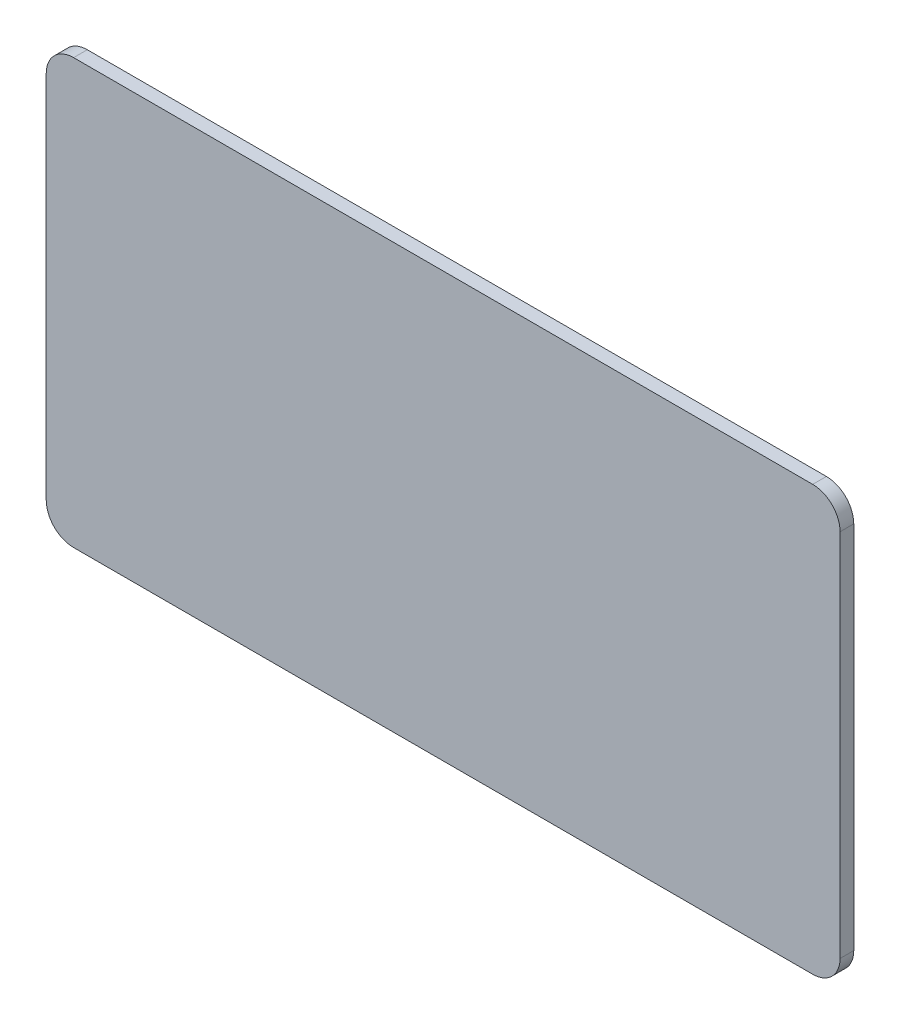
ISO-10303-21;
HEADER;
FILE_DESCRIPTION(('STEP AP214'),'2;1');
FILE_NAME('part.step','',(''),(''),'','','');
FILE_SCHEMA(('AUTOMOTIVE_DESIGN { 1 0 10303 214 1 1 1 1 }'));
ENDSEC;
DATA;
#1=APPLICATION_CONTEXT('core data for automotive mechanical design processes');
#2=APPLICATION_PROTOCOL_DEFINITION('international standard','automotive_design',2000,#1);
#3=PRODUCT_CONTEXT('',#1,'mechanical');
#4=PRODUCT('Part','Part','',(#3));
#5=PRODUCT_RELATED_PRODUCT_CATEGORY('part','',(#4));
#6=PRODUCT_DEFINITION_FORMATION('','',#4);
#7=PRODUCT_DEFINITION_CONTEXT('part definition',#1,'design');
#8=PRODUCT_DEFINITION('design','',#6,#7);
#9=PRODUCT_DEFINITION_SHAPE('','',#8);
#10=(LENGTH_UNIT() NAMED_UNIT(*) SI_UNIT(.MILLI.,.METRE.));
#11=(NAMED_UNIT(*) PLANE_ANGLE_UNIT() SI_UNIT($,.RADIAN.));
#12=(NAMED_UNIT(*) SI_UNIT($,.STERADIAN.) SOLID_ANGLE_UNIT());
#13=UNCERTAINTY_MEASURE_WITH_UNIT(LENGTH_MEASURE(1.E-05),#10,'distance_accuracy_value','');
#14=(GEOMETRIC_REPRESENTATION_CONTEXT(3) GLOBAL_UNCERTAINTY_ASSIGNED_CONTEXT((#13)) GLOBAL_UNIT_ASSIGNED_CONTEXT((#10,
#11,#12)) REPRESENTATION_CONTEXT('',''));
#15=CARTESIAN_POINT('',(0.,0.,0.));
#16=DIRECTION('',(0.,0.,1.));
#17=DIRECTION('',(1.,0.,0.));
#18=AXIS2_PLACEMENT_3D('',#15,#16,#17);
#19=CARTESIAN_POINT('',(9.99999999999997,145.,5.));
#20=DIRECTION('',(0.,0.,-1.));
#21=DIRECTION('',(-1.,0.,0.));
#22=AXIS2_PLACEMENT_3D('',#19,#20,#21);
#23=CYLINDRICAL_SURFACE('',#22,10.);
#24=CARTESIAN_POINT('',(9.99999999999997,145.,0.));
#25=DIRECTION('',(0.,0.,1.));
#26=DIRECTION('',(-1.,0.,0.));
#27=AXIS2_PLACEMENT_3D('',#24,#25,#26);
#28=CIRCLE('',#27,10.);
#29=CARTESIAN_POINT('',(10.,155.,0.));
#30=VERTEX_POINT('',#29);
#31=CARTESIAN_POINT('',(0.,145.,0.));
#32=VERTEX_POINT('',#31);
#33=EDGE_CURVE('E129',#30,#32,#28,.T.);
#34=ORIENTED_EDGE('',*,*,#33,.T.);
#35=DIRECTION('',(0.,0.,-1.));
#36=VECTOR('',#35,1.);
#37=CARTESIAN_POINT('',(0.,145.,5.));
#38=LINE('',#37,#36);
#39=CARTESIAN_POINT('',(0.,145.,5.));
#40=VERTEX_POINT('',#39);
#41=EDGE_CURVE('E11',#40,#32,#38,.T.);
#42=ORIENTED_EDGE('',*,*,#41,.F.);
#43=CARTESIAN_POINT('',(9.99999999999997,145.,5.));
#44=DIRECTION('',(0.,0.,1.));
#45=DIRECTION('',(-1.,0.,0.));
#46=AXIS2_PLACEMENT_3D('',#43,#44,#45);
#47=CIRCLE('',#46,10.);
#48=CARTESIAN_POINT('',(10.,155.,5.));
#49=VERTEX_POINT('',#48);
#50=EDGE_CURVE('E143',#49,#40,#47,.T.);
#51=ORIENTED_EDGE('',*,*,#50,.F.);
#52=DIRECTION('',(0.,0.,-1.));
#53=VECTOR('',#52,1.);
#54=CARTESIAN_POINT('',(10.,155.,5.));
#55=LINE('',#54,#53);
#56=EDGE_CURVE('E125',#49,#30,#55,.T.);
#57=ORIENTED_EDGE('',*,*,#56,.T.);
#58=EDGE_LOOP('',(#34,#42,#51,#57));
#59=FACE_BOUND('',#58,.T.);
#60=ADVANCED_FACE('F33',(#59),#23,.T.);
#61=CARTESIAN_POINT('',(0.,10.0000000000001,5.));
#62=DIRECTION('',(1.,0.,0.));
#63=DIRECTION('',(0.,1.,0.));
#64=AXIS2_PLACEMENT_3D('',#61,#62,#63);
#65=PLANE('',#64);
#66=DIRECTION('',(0.,-1.,0.));
#67=VECTOR('',#66,1.);
#68=CARTESIAN_POINT('',(0.,10.0000000000001,0.));
#69=LINE('',#68,#67);
#70=CARTESIAN_POINT('',(0.,10.0000000000001,0.));
#71=VERTEX_POINT('',#70);
#72=EDGE_CURVE('E132',#32,#71,#69,.T.);
#73=ORIENTED_EDGE('',*,*,#72,.T.);
#74=DIRECTION('',(0.,0.,-1.));
#75=VECTOR('',#74,1.);
#76=CARTESIAN_POINT('',(0.,10.0000000000001,5.));
#77=LINE('',#76,#75);
#78=CARTESIAN_POINT('',(0.,10.0000000000001,5.));
#79=VERTEX_POINT('',#78);
#80=EDGE_CURVE('E41',#79,#71,#77,.T.);
#81=ORIENTED_EDGE('',*,*,#80,.F.);
#82=DIRECTION('',(0.,-1.,0.));
#83=VECTOR('',#82,1.);
#84=CARTESIAN_POINT('',(0.,10.0000000000001,5.));
#85=LINE('',#84,#83);
#86=EDGE_CURVE('E92',#40,#79,#85,.T.);
#87=ORIENTED_EDGE('',*,*,#86,.F.);
#88=ORIENTED_EDGE('',*,*,#41,.T.);
#89=EDGE_LOOP('',(#73,#81,#87,#88));
#90=FACE_BOUND('',#89,.T.);
#91=ADVANCED_FACE('F178',(#90),#65,.F.);
#92=CARTESIAN_POINT('',(10.,10.,5.));
#93=DIRECTION('',(0.,0.,-1.));
#94=DIRECTION('',(-1.,0.,0.));
#95=AXIS2_PLACEMENT_3D('',#92,#93,#94);
#96=CYLINDRICAL_SURFACE('',#95,10.);
#97=CARTESIAN_POINT('',(10.,10.,0.));
#98=DIRECTION('',(0.,0.,1.));
#99=DIRECTION('',(-1.,0.,0.));
#100=AXIS2_PLACEMENT_3D('',#97,#98,#99);
#101=CIRCLE('',#100,10.);
#102=CARTESIAN_POINT('',(10.0000000000001,0.,0.));
#103=VERTEX_POINT('',#102);
#104=EDGE_CURVE('E134',#71,#103,#101,.T.);
#105=ORIENTED_EDGE('',*,*,#104,.T.);
#106=DIRECTION('',(0.,0.,-1.));
#107=VECTOR('',#106,1.);
#108=CARTESIAN_POINT('',(10.0000000000001,0.,5.));
#109=LINE('',#108,#107);
#110=CARTESIAN_POINT('',(10.0000000000001,0.,5.));
#111=VERTEX_POINT('',#110);
#112=EDGE_CURVE('E150',#111,#103,#109,.T.);
#113=ORIENTED_EDGE('',*,*,#112,.F.);
#114=CARTESIAN_POINT('',(10.,10.,5.));
#115=DIRECTION('',(0.,0.,1.));
#116=DIRECTION('',(-1.,0.,0.));
#117=AXIS2_PLACEMENT_3D('',#114,#115,#116);
#118=CIRCLE('',#117,10.);
#119=EDGE_CURVE('E158',#79,#111,#118,.T.);
#120=ORIENTED_EDGE('',*,*,#119,.F.);
#121=ORIENTED_EDGE('',*,*,#80,.T.);
#122=EDGE_LOOP('',(#105,#113,#120,#121));
#123=FACE_BOUND('',#122,.T.);
#124=ADVANCED_FACE('F156',(#123),#96,.T.);
#125=CARTESIAN_POINT('',(10.0000000000001,0.,5.));
#126=DIRECTION('',(0.,1.,0.));
#127=DIRECTION('',(-1.,0.,0.));
#128=AXIS2_PLACEMENT_3D('',#125,#126,#127);
#129=PLANE('',#128);
#130=DIRECTION('',(1.,0.,0.));
#131=VECTOR('',#130,1.);
#132=CARTESIAN_POINT('',(10.0000000000001,0.,0.));
#133=LINE('',#132,#131);
#134=CARTESIAN_POINT('',(280.,0.,0.));
#135=VERTEX_POINT('',#134);
#136=EDGE_CURVE('E136',#103,#135,#133,.T.);
#137=ORIENTED_EDGE('',*,*,#136,.T.);
#138=DIRECTION('',(0.,0.,-1.));
#139=VECTOR('',#138,1.);
#140=CARTESIAN_POINT('',(280.,0.,5.));
#141=LINE('',#140,#139);
#142=CARTESIAN_POINT('',(280.,0.,5.));
#143=VERTEX_POINT('',#142);
#144=EDGE_CURVE('E147',#143,#135,#141,.T.);
#145=ORIENTED_EDGE('',*,*,#144,.F.);
#146=DIRECTION('',(1.,0.,0.));
#147=VECTOR('',#146,1.);
#148=CARTESIAN_POINT('',(10.0000000000001,0.,5.));
#149=LINE('',#148,#147);
#150=EDGE_CURVE('E170',#111,#143,#149,.T.);
#151=ORIENTED_EDGE('',*,*,#150,.F.);
#152=ORIENTED_EDGE('',*,*,#112,.T.);
#153=EDGE_LOOP('',(#137,#145,#151,#152));
#154=FACE_BOUND('',#153,.T.);
#155=ADVANCED_FACE('F166',(#154),#129,.F.);
#156=CARTESIAN_POINT('',(280.,10.,5.));
#157=DIRECTION('',(0.,0.,-1.));
#158=DIRECTION('',(-1.,0.,0.));
#159=AXIS2_PLACEMENT_3D('',#156,#157,#158);
#160=CYLINDRICAL_SURFACE('',#159,10.);
#161=CARTESIAN_POINT('',(280.,10.,0.));
#162=DIRECTION('',(0.,0.,1.));
#163=DIRECTION('',(1.,0.,0.));
#164=AXIS2_PLACEMENT_3D('',#161,#162,#163);
#165=CIRCLE('',#164,10.);
#166=CARTESIAN_POINT('',(290.,10.,0.));
#167=VERTEX_POINT('',#166);
#168=EDGE_CURVE('E138',#135,#167,#165,.T.);
#169=ORIENTED_EDGE('',*,*,#168,.T.);
#170=DIRECTION('',(0.,0.,-1.));
#171=VECTOR('',#170,1.);
#172=CARTESIAN_POINT('',(290.,10.,5.));
#173=LINE('',#172,#171);
#174=CARTESIAN_POINT('',(290.,10.,5.));
#175=VERTEX_POINT('',#174);
#176=EDGE_CURVE('E120',#175,#167,#173,.T.);
#177=ORIENTED_EDGE('',*,*,#176,.F.);
#178=CARTESIAN_POINT('',(280.,10.,5.));
#179=DIRECTION('',(0.,0.,1.));
#180=DIRECTION('',(1.,0.,0.));
#181=AXIS2_PLACEMENT_3D('',#178,#179,#180);
#182=CIRCLE('',#181,10.);
#183=EDGE_CURVE('E111',#143,#175,#182,.T.);
#184=ORIENTED_EDGE('',*,*,#183,.F.);
#185=ORIENTED_EDGE('',*,*,#144,.T.);
#186=EDGE_LOOP('',(#169,#177,#184,#185));
#187=FACE_BOUND('',#186,.T.);
#188=ADVANCED_FACE('F169',(#187),#160,.T.);
#189=CARTESIAN_POINT('',(290.,10.0000000000001,5.));
#190=DIRECTION('',(-1.,0.,0.));
#191=DIRECTION('',(0.,0.,1.));
#192=AXIS2_PLACEMENT_3D('',#189,#190,#191);
#193=PLANE('',#192);
#194=DIRECTION('',(0.,1.,0.));
#195=VECTOR('',#194,1.);
#196=CARTESIAN_POINT('',(290.,10.0000000000001,0.));
#197=LINE('',#196,#195);
#198=CARTESIAN_POINT('',(290.,145.,0.));
#199=VERTEX_POINT('',#198);
#200=EDGE_CURVE('E119',#167,#199,#197,.T.);
#201=ORIENTED_EDGE('',*,*,#200,.T.);
#202=DIRECTION('',(0.,0.,-1.));
#203=VECTOR('',#202,1.);
#204=CARTESIAN_POINT('',(290.,145.,5.));
#205=LINE('',#204,#203);
#206=CARTESIAN_POINT('',(290.,145.,5.));
#207=VERTEX_POINT('',#206);
#208=EDGE_CURVE('E116',#207,#199,#205,.T.);
#209=ORIENTED_EDGE('',*,*,#208,.F.);
#210=DIRECTION('',(0.,1.,0.));
#211=VECTOR('',#210,1.);
#212=CARTESIAN_POINT('',(290.,10.0000000000001,5.));
#213=LINE('',#212,#211);
#214=EDGE_CURVE('E105',#175,#207,#213,.T.);
#215=ORIENTED_EDGE('',*,*,#214,.F.);
#216=ORIENTED_EDGE('',*,*,#176,.T.);
#217=EDGE_LOOP('',(#201,#209,#215,#216));
#218=FACE_BOUND('',#217,.T.);
#219=ADVANCED_FACE('F117',(#218),#193,.F.);
#220=CARTESIAN_POINT('',(280.,145.,5.));
#221=DIRECTION('',(0.,0.,-1.));
#222=DIRECTION('',(-1.,0.,0.));
#223=AXIS2_PLACEMENT_3D('',#220,#221,#222);
#224=CYLINDRICAL_SURFACE('',#223,10.);
#225=CARTESIAN_POINT('',(280.,145.,0.));
#226=DIRECTION('',(0.,0.,1.));
#227=DIRECTION('',(-1.,0.,0.));
#228=AXIS2_PLACEMENT_3D('',#225,#226,#227);
#229=CIRCLE('',#228,10.);
#230=CARTESIAN_POINT('',(280.,155.,0.));
#231=VERTEX_POINT('',#230);
#232=EDGE_CURVE('E78',#199,#231,#229,.T.);
#233=ORIENTED_EDGE('',*,*,#232,.T.);
#234=DIRECTION('',(0.,0.,-1.));
#235=VECTOR('',#234,1.);
#236=CARTESIAN_POINT('',(280.,155.,5.));
#237=LINE('',#236,#235);
#238=CARTESIAN_POINT('',(280.,155.,5.));
#239=VERTEX_POINT('',#238);
#240=EDGE_CURVE('E121',#239,#231,#237,.T.);
#241=ORIENTED_EDGE('',*,*,#240,.F.);
#242=CARTESIAN_POINT('',(280.,145.,5.));
#243=DIRECTION('',(0.,0.,1.));
#244=DIRECTION('',(-1.,0.,0.));
#245=AXIS2_PLACEMENT_3D('',#242,#243,#244);
#246=CIRCLE('',#245,10.);
#247=EDGE_CURVE('E109',#207,#239,#246,.T.);
#248=ORIENTED_EDGE('',*,*,#247,.F.);
#249=ORIENTED_EDGE('',*,*,#208,.T.);
#250=EDGE_LOOP('',(#233,#241,#248,#249));
#251=FACE_BOUND('',#250,.T.);
#252=ADVANCED_FACE('F123',(#251),#224,.T.);
#253=CARTESIAN_POINT('',(10.,155.,5.));
#254=DIRECTION('',(0.,-1.,0.));
#255=DIRECTION('',(1.,0.,0.));
#256=AXIS2_PLACEMENT_3D('',#253,#254,#255);
#257=PLANE('',#256);
#258=DIRECTION('',(-1.,0.,0.));
#259=VECTOR('',#258,1.);
#260=CARTESIAN_POINT('',(10.,155.,0.));
#261=LINE('',#260,#259);
#262=EDGE_CURVE('E84',#231,#30,#261,.T.);
#263=ORIENTED_EDGE('',*,*,#262,.T.);
#264=ORIENTED_EDGE('',*,*,#56,.F.);
#265=DIRECTION('',(-1.,0.,0.));
#266=VECTOR('',#265,1.);
#267=CARTESIAN_POINT('',(10.,155.,5.));
#268=LINE('',#267,#266);
#269=EDGE_CURVE('E49',#239,#49,#268,.T.);
#270=ORIENTED_EDGE('',*,*,#269,.F.);
#271=ORIENTED_EDGE('',*,*,#240,.T.);
#272=EDGE_LOOP('',(#263,#264,#270,#271));
#273=FACE_BOUND('',#272,.T.);
#274=ADVANCED_FACE('F194',(#273),#257,.F.);
#275=CARTESIAN_POINT('',(9.99999999999997,145.,5.));
#276=DIRECTION('',(0.,0.,-1.));
#277=DIRECTION('',(-1.,0.,0.));
#278=AXIS2_PLACEMENT_3D('',#275,#276,#277);
#279=PLANE('',#278);
#280=ORIENTED_EDGE('',*,*,#50,.T.);
#281=ORIENTED_EDGE('',*,*,#86,.T.);
#282=ORIENTED_EDGE('',*,*,#119,.T.);
#283=ORIENTED_EDGE('',*,*,#150,.T.);
#284=ORIENTED_EDGE('',*,*,#183,.T.);
#285=ORIENTED_EDGE('',*,*,#214,.T.);
#286=ORIENTED_EDGE('',*,*,#247,.T.);
#287=ORIENTED_EDGE('',*,*,#269,.T.);
#288=EDGE_LOOP('',(#280,#281,#282,#283,#284,#285,#286,#287));
#289=FACE_BOUND('',#288,.T.);
#290=ADVANCED_FACE('F107',(#289),#279,.F.);
#291=CARTESIAN_POINT('',(9.99999999999997,145.,0.));
#292=DIRECTION('',(0.,0.,-1.));
#293=DIRECTION('',(-1.,0.,0.));
#294=AXIS2_PLACEMENT_3D('',#291,#292,#293);
#295=PLANE('',#294);
#296=ORIENTED_EDGE('',*,*,#33,.F.);
#297=ORIENTED_EDGE('',*,*,#262,.F.);
#298=ORIENTED_EDGE('',*,*,#232,.F.);
#299=ORIENTED_EDGE('',*,*,#200,.F.);
#300=ORIENTED_EDGE('',*,*,#168,.F.);
#301=ORIENTED_EDGE('',*,*,#136,.F.);
#302=ORIENTED_EDGE('',*,*,#104,.F.);
#303=ORIENTED_EDGE('',*,*,#72,.F.);
#304=EDGE_LOOP('',(#296,#297,#298,#299,#300,#301,#302,#303));
#305=FACE_BOUND('',#304,.T.);
#306=ADVANCED_FACE('F162',(#305),#295,.T.);
#307=CLOSED_SHELL('',(#60,#91,#124,#155,#188,#219,#252,#274,#290,#306));
#308=MANIFOLD_SOLID_BREP('B2',#307);
#309=ADVANCED_BREP_SHAPE_REPRESENTATION('',(#18,#308),#14);
#310=SHAPE_DEFINITION_REPRESENTATION(#9,#309);
ENDSEC;
END-ISO-10303-21;
